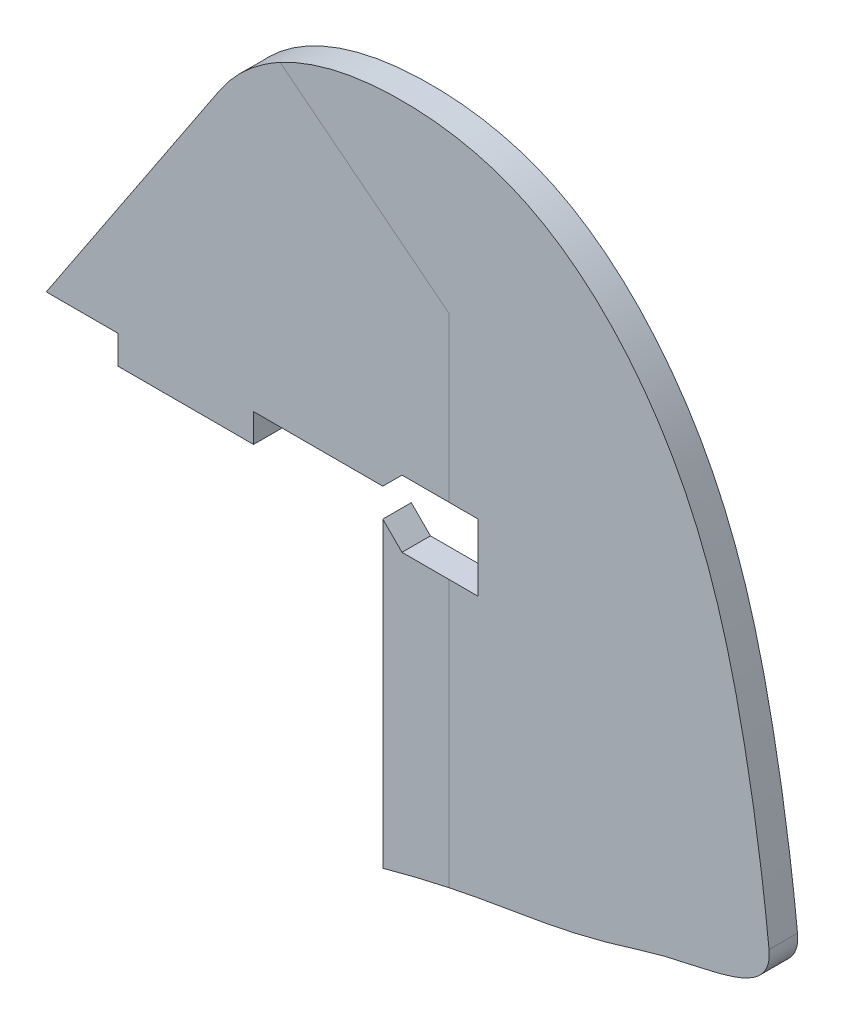
ISO-10303-21;
HEADER;
FILE_DESCRIPTION(('STEP AP214'),'2;1');
FILE_NAME('part.step','',(''),(''),'','','');
FILE_SCHEMA(('AUTOMOTIVE_DESIGN { 1 0 10303 214 1 1 1 1 }'));
ENDSEC;
DATA;
#1=APPLICATION_CONTEXT('core data for automotive mechanical design processes');
#2=APPLICATION_PROTOCOL_DEFINITION('international standard','automotive_design',2000,#1);
#3=PRODUCT_CONTEXT('',#1,'mechanical');
#4=PRODUCT('Part','Part','',(#3));
#5=PRODUCT_RELATED_PRODUCT_CATEGORY('part','',(#4));
#6=PRODUCT_DEFINITION_FORMATION('','',#4);
#7=PRODUCT_DEFINITION_CONTEXT('part definition',#1,'design');
#8=PRODUCT_DEFINITION('design','',#6,#7);
#9=PRODUCT_DEFINITION_SHAPE('','',#8);
#10=(LENGTH_UNIT() NAMED_UNIT(*) SI_UNIT(.MILLI.,.METRE.));
#11=(NAMED_UNIT(*) PLANE_ANGLE_UNIT() SI_UNIT($,.RADIAN.));
#12=(NAMED_UNIT(*) SI_UNIT($,.STERADIAN.) SOLID_ANGLE_UNIT());
#13=UNCERTAINTY_MEASURE_WITH_UNIT(LENGTH_MEASURE(1.E-05),#10,'distance_accuracy_value','');
#14=(GEOMETRIC_REPRESENTATION_CONTEXT(3) GLOBAL_UNCERTAINTY_ASSIGNED_CONTEXT((#13)) GLOBAL_UNIT_ASSIGNED_CONTEXT((#10,
#11,#12)) REPRESENTATION_CONTEXT('',''));
#15=CARTESIAN_POINT('',(0.,0.,0.));
#16=DIRECTION('',(0.,0.,1.));
#17=DIRECTION('',(1.,0.,0.));
#18=AXIS2_PLACEMENT_3D('',#15,#16,#17);
#19=CARTESIAN_POINT('',(0.,0.,2.667));
#20=DIRECTION('',(0.,0.,1.));
#21=DIRECTION('',(1.,0.,0.));
#22=AXIS2_PLACEMENT_3D('',#19,#20,#21);
#23=PLANE('',#22);
#24=DIRECTION('',(-0.707106781186552,-0.707106781186543,0.));
#25=VECTOR('',#24,1.);
#26=CARTESIAN_POINT('',(65.666068366198,4.00697940226357,2.667));
#27=LINE('',#26,#25);
#28=CARTESIAN_POINT('',(69.2581708146257,7.59908185069121,2.667));
#29=VERTEX_POINT('',#28);
#30=CARTESIAN_POINT('',(65.666068366198,4.00697940226357,2.667));
#31=VERTEX_POINT('',#30);
#32=EDGE_CURVE('E176',#29,#31,#27,.T.);
#33=ORIENTED_EDGE('',*,*,#32,.F.);
#34=DIRECTION('',(-1.,0.,0.));
#35=VECTOR('',#34,1.);
#36=CARTESIAN_POINT('',(83.446068366198,7.59908185069121,2.667));
#37=LINE('',#36,#35);
#38=CARTESIAN_POINT('',(78.0167474840947,7.59908185069121,2.667));
#39=VERTEX_POINT('',#38);
#40=EDGE_CURVE('E221',#39,#29,#37,.T.);
#41=ORIENTED_EDGE('',*,*,#40,.F.);
#42=DIRECTION('',(0.,1.,0.));
#43=VECTOR('',#42,1.);
#44=CARTESIAN_POINT('',(78.0167474840942,0.,2.667));
#45=LINE('',#44,#43);
#46=CARTESIAN_POINT('',(78.0167474840942,38.2575824735706,2.667));
#47=VERTEX_POINT('',#46);
#48=EDGE_CURVE('E203',#39,#47,#45,.T.);
#49=ORIENTED_EDGE('',*,*,#48,.T.);
#50=DIRECTION('',(-0.785764351366818,0.618525976916964,0.));
#51=VECTOR('',#50,1.);
#52=CARTESIAN_POINT('',(48.4409934326575,61.5385726787128,2.667));
#53=LINE('',#52,#51);
#54=CARTESIAN_POINT('',(46.4420874905384,63.1120409391049,2.667));
#55=VERTEX_POINT('',#54);
#56=EDGE_CURVE('E11',#47,#55,#53,.T.);
#57=ORIENTED_EDGE('',*,*,#56,.T.);
#58=CARTESIAN_POINT('',(35.1256612889572,52.9106732040363,2.667));
#59=CARTESIAN_POINT('',(37.9474296397344,57.1611743358798,2.667));
#60=CARTESIAN_POINT('',(47.971102481466,65.9423291174564,2.667));
#61=CARTESIAN_POINT('',(69.0084378411423,69.7517440980403,2.667));
#62=CARTESIAN_POINT('',(98.5076264172588,64.2411874513066,2.667));
#63=CARTESIAN_POINT('',(123.102162866821,36.6885902774405,2.667));
#64=CARTESIAN_POINT('',(133.317484482186,0.0651109229383884,2.667));
#65=CARTESIAN_POINT('',(136.807881475191,-23.8429808112873,2.667));
#66=CARTESIAN_POINT('',(137.976029916118,-34.9736234866786,2.667));
#67=B_SPLINE_CURVE_WITH_KNOTS('',3,(#58,#59,#60,#61,#62,#63,#64,#65,#66),.UNSPECIFIED.,.F.,.F.,
(4,1,1,1,1,1,4),(0.,0.0832450330887692,0.226858925181421,0.34728898037586,0.588091298684175,
0.805835077836797,1.),.UNSPECIFIED.);
#68=CARTESIAN_POINT('',(35.1256612889572,52.9106732040363,2.667));
#69=VERTEX_POINT('',#68);
#70=EDGE_CURVE('E231',#69,#55,#67,.T.);
#71=ORIENTED_EDGE('',*,*,#70,.F.);
#72=DIRECTION('',(0.553084487201441,0.833125170677924,0.));
#73=VECTOR('',#72,1.);
#74=CARTESIAN_POINT('',(0.,0.,2.667));
#75=LINE('',#74,#73);
#76=CARTESIAN_POINT('',(2.66010225825289,4.00697940226356,2.667));
#77=VERTEX_POINT('',#76);
#78=EDGE_CURVE('E237',#77,#69,#75,.T.);
#79=ORIENTED_EDGE('',*,*,#78,.F.);
#80=DIRECTION('',(-1.,0.,0.));
#81=VECTOR('',#80,1.);
#82=CARTESIAN_POINT('',(0.,4.00697940226356,2.667));
#83=LINE('',#82,#81);
#84=CARTESIAN_POINT('',(16.0757641262611,4.00697940226356,2.667));
#85=VERTEX_POINT('',#84);
#86=EDGE_CURVE('E238',#85,#77,#83,.T.);
#87=ORIENTED_EDGE('',*,*,#86,.F.);
#88=DIRECTION('',(0.,1.,0.));
#89=VECTOR('',#88,1.);
#90=CARTESIAN_POINT('',(16.0757641262611,-1.32702059773643,2.667));
#91=LINE('',#90,#89);
#92=CARTESIAN_POINT('',(16.0757641262611,-1.32702059773643,2.667));
#93=VERTEX_POINT('',#92);
#94=EDGE_CURVE('E345',#93,#85,#91,.T.);
#95=ORIENTED_EDGE('',*,*,#94,.F.);
#96=DIRECTION('',(-1.,0.,0.));
#97=VECTOR('',#96,1.);
#98=CARTESIAN_POINT('',(41.4757641262611,-1.32702059773643,2.667));
#99=LINE('',#98,#97);
#100=CARTESIAN_POINT('',(41.4757641262611,-1.32702059773643,2.667));
#101=VERTEX_POINT('',#100);
#102=EDGE_CURVE('E338',#101,#93,#99,.T.);
#103=ORIENTED_EDGE('',*,*,#102,.F.);
#104=DIRECTION('',(0.,1.,0.));
#105=VECTOR('',#104,1.);
#106=CARTESIAN_POINT('',(41.4757641262611,-1.32702059773643,2.667));
#107=LINE('',#106,#105);
#108=CARTESIAN_POINT('',(41.4757641262611,4.00697940226357,2.667));
#109=VERTEX_POINT('',#108);
#110=EDGE_CURVE('E347',#101,#109,#107,.T.);
#111=ORIENTED_EDGE('',*,*,#110,.T.);
#112=EDGE_CURVE('E373',#31,#109,#83,.T.);
#113=ORIENTED_EDGE('',*,*,#112,.F.);
#114=EDGE_LOOP('',(#33,#41,#49,#57,#71,#79,#87,#95,#103,#111,#113));
#115=FACE_BOUND('',#114,.T.);
#116=ADVANCED_FACE('F40',(#115),#23,.T.);
#117=CARTESIAN_POINT('',(0.,4.00697940226356,2.667));
#118=DIRECTION('',(0.,-1.,0.));
#119=DIRECTION('',(1.,0.,0.));
#120=AXIS2_PLACEMENT_3D('',#117,#118,#119);
#121=PLANE('',#120);
#122=ORIENTED_EDGE('',*,*,#112,.T.);
#123=DIRECTION('',(0.,0.,1.));
#124=VECTOR('',#123,1.);
#125=CARTESIAN_POINT('',(41.4757641262611,4.00697940226357,-2.667));
#126=LINE('',#125,#124);
#127=CARTESIAN_POINT('',(41.4757641262611,4.00697940226357,-2.667));
#128=VERTEX_POINT('',#127);
#129=EDGE_CURVE('E165',#128,#109,#126,.T.);
#130=ORIENTED_EDGE('',*,*,#129,.F.);
#131=DIRECTION('',(-1.,0.,0.));
#132=VECTOR('',#131,1.);
#133=CARTESIAN_POINT('',(0.,4.00697940226356,-2.667));
#134=LINE('',#133,#132);
#135=CARTESIAN_POINT('',(65.666068366198,4.00697940226357,-2.667));
#136=VERTEX_POINT('',#135);
#137=EDGE_CURVE('E185',#136,#128,#134,.T.);
#138=ORIENTED_EDGE('',*,*,#137,.F.);
#139=DIRECTION('',(0.,0.,-1.));
#140=VECTOR('',#139,1.);
#141=CARTESIAN_POINT('',(65.666068366198,4.00697940226357,2.667));
#142=LINE('',#141,#140);
#143=EDGE_CURVE('E195',#31,#136,#142,.T.);
#144=ORIENTED_EDGE('',*,*,#143,.F.);
#145=EDGE_LOOP('',(#122,#130,#138,#144));
#146=FACE_BOUND('',#145,.T.);
#147=ADVANCED_FACE('F257',(#146),#121,.T.);
#148=CARTESIAN_POINT('',(16.0757641262611,4.00697940226356,-2.667));
#149=VERTEX_POINT('',#148);
#150=CARTESIAN_POINT('',(2.66010225825289,4.00697940226356,-2.667));
#151=VERTEX_POINT('',#150);
#152=EDGE_CURVE('E189',#149,#151,#134,.T.);
#153=ORIENTED_EDGE('',*,*,#152,.F.);
#154=DIRECTION('',(0.,0.,-1.));
#155=VECTOR('',#154,1.);
#156=CARTESIAN_POINT('',(16.0757641262611,4.00697940226356,2.667));
#157=LINE('',#156,#155);
#158=EDGE_CURVE('E336',#85,#149,#157,.T.);
#159=ORIENTED_EDGE('',*,*,#158,.F.);
#160=ORIENTED_EDGE('',*,*,#86,.T.);
#161=DIRECTION('',(0.,0.,-1.));
#162=VECTOR('',#161,1.);
#163=CARTESIAN_POINT('',(2.66010225825289,4.00697940226356,2.667));
#164=LINE('',#163,#162);
#165=EDGE_CURVE('E197',#77,#151,#164,.T.);
#166=ORIENTED_EDGE('',*,*,#165,.T.);
#167=EDGE_LOOP('',(#153,#159,#160,#166));
#168=FACE_BOUND('',#167,.T.);
#169=ADVANCED_FACE('F260',(#168),#121,.T.);
#170=DIRECTION('',(1.,0.,0.));
#171=VECTOR('',#170,1.);
#172=CARTESIAN_POINT('',(83.446068366198,-4.91912304616406,2.667));
#173=LINE('',#172,#171);
#174=CARTESIAN_POINT('',(69.2581708146257,-4.91912304616406,2.667));
#175=VERTEX_POINT('',#174);
#176=CARTESIAN_POINT('',(78.0167474840947,-4.91912304616406,2.667));
#177=VERTEX_POINT('',#176);
#178=EDGE_CURVE('E310',#175,#177,#173,.T.);
#179=ORIENTED_EDGE('',*,*,#178,.F.);
#180=DIRECTION('',(0.707106781186554,-0.707106781186541,0.));
#181=VECTOR('',#180,1.);
#182=CARTESIAN_POINT('',(65.666068366198,-1.32702059773643,2.667));
#183=LINE('',#182,#181);
#184=CARTESIAN_POINT('',(65.666068366198,-1.32702059773643,2.667));
#185=VERTEX_POINT('',#184);
#186=EDGE_CURVE('E311',#185,#175,#183,.T.);
#187=ORIENTED_EDGE('',*,*,#186,.F.);
#188=DIRECTION('',(0.,1.,0.));
#189=VECTOR('',#188,1.);
#190=CARTESIAN_POINT('',(65.666068366198,0.,2.667));
#191=LINE('',#190,#189);
#192=CARTESIAN_POINT('',(65.666068366198,-57.9377529334846,2.667));
#193=VERTEX_POINT('',#192);
#194=EDGE_CURVE('E175',#193,#185,#191,.T.);
#195=ORIENTED_EDGE('',*,*,#194,.F.);
#196=CARTESIAN_POINT('',(137.976029916118,-34.9736234866786,2.667));
#197=CARTESIAN_POINT('',(138.815150474857,-42.9691408144953,2.667));
#198=CARTESIAN_POINT('',(124.639937030782,-43.6094816377659,2.667));
#199=CARTESIAN_POINT('',(103.232724242995,-50.5799985559844,2.667));
#200=CARTESIAN_POINT('',(88.6279712284508,-52.8063297096414,2.667));
#201=CARTESIAN_POINT('',(74.9940482948041,-55.3616650293275,2.667));
#202=CARTESIAN_POINT('',(65.666068366198,-57.9377529334846,2.667));
#203=B_SPLINE_CURVE_WITH_KNOTS('',3,(#196,#197,#198,#199,#200,#201,#202),.UNSPECIFIED.,.F.,.F.,
(4,1,1,1,4),(0.,0.302584462495957,0.371889791965306,0.693053294693484,1.),.UNSPECIFIED.);
#204=CARTESIAN_POINT('',(78.0167474840951,-54.9113959111609,2.667));
#205=VERTEX_POINT('',#204);
#206=EDGE_CURVE('E184',#205,#193,#203,.T.);
#207=ORIENTED_EDGE('',*,*,#206,.F.);
#208=EDGE_CURVE('E50',#205,#177,#45,.T.);
#209=ORIENTED_EDGE('',*,*,#208,.T.);
#210=EDGE_LOOP('',(#179,#187,#195,#207,#209));
#211=FACE_BOUND('',#210,.T.);
#212=ADVANCED_FACE('F269',(#211),#23,.T.);
#213=DIRECTION('',(0.,0.,-1.));
#214=VECTOR('',#213,1.);
#215=SURFACE_OF_LINEAR_EXTRUSION('',#203,#214);
#216=CARTESIAN_POINT('',(137.976029916118,-34.9736234866786,-2.667));
#217=CARTESIAN_POINT('',(138.815150474857,-42.9691408144953,-2.667));
#218=CARTESIAN_POINT('',(124.639937030782,-43.6094816377659,-2.667));
#219=CARTESIAN_POINT('',(103.232724242995,-50.5799985559844,-2.667));
#220=CARTESIAN_POINT('',(88.6279712284508,-52.8063297096414,-2.667));
#221=CARTESIAN_POINT('',(74.9940482948041,-55.3616650293275,-2.667));
#222=CARTESIAN_POINT('',(65.666068366198,-57.9377529334846,-2.667));
#223=B_SPLINE_CURVE_WITH_KNOTS('',3,(#216,#217,#218,#219,#220,#221,#222),.UNSPECIFIED.,.F.,.F.,
(4,1,1,1,4),(0.,0.302584462495957,0.371889791965306,0.693053294693484,1.),.UNSPECIFIED.);
#224=CARTESIAN_POINT('',(137.976029916118,-34.9736234866786,-2.667));
#225=VERTEX_POINT('',#224);
#226=CARTESIAN_POINT('',(65.666068366198,-57.9377529334846,-2.667));
#227=VERTEX_POINT('',#226);
#228=EDGE_CURVE('E183',#225,#227,#223,.T.);
#229=ORIENTED_EDGE('',*,*,#228,.F.);
#230=DIRECTION('',(0.,0.,-1.));
#231=VECTOR('',#230,1.);
#232=CARTESIAN_POINT('',(137.976029916118,-34.9736234866786,2.667));
#233=LINE('',#232,#231);
#234=CARTESIAN_POINT('',(137.976029916118,-34.9736234866786,2.667));
#235=VERTEX_POINT('',#234);
#236=EDGE_CURVE('E202',#235,#225,#233,.T.);
#237=ORIENTED_EDGE('',*,*,#236,.F.);
#238=EDGE_CURVE('E187',#235,#205,#203,.T.);
#239=ORIENTED_EDGE('',*,*,#238,.T.);
#240=ORIENTED_EDGE('',*,*,#206,.T.);
#241=DIRECTION('',(0.,0.,-1.));
#242=VECTOR('',#241,1.);
#243=CARTESIAN_POINT('',(65.666068366198,-57.9377529334846,2.667));
#244=LINE('',#243,#242);
#245=EDGE_CURVE('E193',#193,#227,#244,.T.);
#246=ORIENTED_EDGE('',*,*,#245,.T.);
#247=EDGE_LOOP('',(#229,#237,#239,#240,#246));
#248=FACE_BOUND('',#247,.T.);
#249=ADVANCED_FACE('F42',(#248),#215,.T.);
#250=DIRECTION('',(0.,0.,-1.));
#251=VECTOR('',#250,1.);
#252=SURFACE_OF_LINEAR_EXTRUSION('',#67,#251);
#253=CARTESIAN_POINT('',(35.1256612889572,52.9106732040363,-2.667));
#254=CARTESIAN_POINT('',(37.9474296397344,57.1611743358798,-2.667));
#255=CARTESIAN_POINT('',(47.971102481466,65.9423291174564,-2.667));
#256=CARTESIAN_POINT('',(69.0084378411423,69.7517440980403,-2.667));
#257=CARTESIAN_POINT('',(98.5076264172588,64.2411874513066,-2.667));
#258=CARTESIAN_POINT('',(123.102162866821,36.6885902774405,-2.667));
#259=CARTESIAN_POINT('',(133.317484482186,0.0651109229383884,-2.667));
#260=CARTESIAN_POINT('',(136.807881475191,-23.8429808112873,-2.667));
#261=CARTESIAN_POINT('',(137.976029916118,-34.9736234866786,-2.667));
#262=B_SPLINE_CURVE_WITH_KNOTS('',3,(#253,#254,#255,#256,#257,#258,#259,#260,#261),
.UNSPECIFIED.,.F.,.F.,(4,1,1,1,1,1,4),(0.,0.0832450330887692,0.226858925181421,0.34728898037586,
0.588091298684175,0.805835077836797,1.),.UNSPECIFIED.);
#263=CARTESIAN_POINT('',(35.1256612889572,52.9106732040363,-2.667));
#264=VERTEX_POINT('',#263);
#265=EDGE_CURVE('E352',#264,#225,#262,.T.);
#266=ORIENTED_EDGE('',*,*,#265,.F.);
#267=DIRECTION('',(0.,0.,-1.));
#268=VECTOR('',#267,1.);
#269=CARTESIAN_POINT('',(35.1256612889572,52.9106732040363,2.667));
#270=LINE('',#269,#268);
#271=EDGE_CURVE('E200',#69,#264,#270,.T.);
#272=ORIENTED_EDGE('',*,*,#271,.F.);
#273=ORIENTED_EDGE('',*,*,#70,.T.);
#274=EDGE_CURVE('E226',#55,#235,#67,.T.);
#275=ORIENTED_EDGE('',*,*,#274,.T.);
#276=ORIENTED_EDGE('',*,*,#236,.T.);
#277=EDGE_LOOP('',(#266,#272,#273,#275,#276));
#278=FACE_BOUND('',#277,.T.);
#279=ADVANCED_FACE('F234',(#278),#252,.T.);
#280=CARTESIAN_POINT('',(0.,0.,2.667));
#281=DIRECTION('',(-0.833125170677923,0.553084487201441,0.));
#282=DIRECTION('',(-0.553084487201441,-0.833125170677923,0.));
#283=AXIS2_PLACEMENT_3D('',#280,#281,#282);
#284=PLANE('',#283);
#285=DIRECTION('',(0.553084487201441,0.833125170677924,0.));
#286=VECTOR('',#285,1.);
#287=CARTESIAN_POINT('',(0.,0.,-2.667));
#288=LINE('',#287,#286);
#289=EDGE_CURVE('E354',#151,#264,#288,.T.);
#290=ORIENTED_EDGE('',*,*,#289,.F.);
#291=ORIENTED_EDGE('',*,*,#165,.F.);
#292=ORIENTED_EDGE('',*,*,#78,.T.);
#293=ORIENTED_EDGE('',*,*,#271,.T.);
#294=EDGE_LOOP('',(#290,#291,#292,#293));
#295=FACE_BOUND('',#294,.T.);
#296=ADVANCED_FACE('F253',(#295),#284,.T.);
#297=CARTESIAN_POINT('',(65.666068366198,0.,2.667));
#298=DIRECTION('',(-1.,0.,0.));
#299=DIRECTION('',(0.,0.,1.));
#300=AXIS2_PLACEMENT_3D('',#297,#298,#299);
#301=PLANE('',#300);
#302=DIRECTION('',(0.,0.,1.));
#303=VECTOR('',#302,1.);
#304=CARTESIAN_POINT('',(65.666068366198,-1.32702059773643,-2.668));
#305=LINE('',#304,#303);
#306=CARTESIAN_POINT('',(65.666068366198,-1.32702059773643,-2.667));
#307=VERTEX_POINT('',#306);
#308=EDGE_CURVE('E161',#307,#185,#305,.T.);
#309=ORIENTED_EDGE('',*,*,#308,.F.);
#310=DIRECTION('',(0.,1.,0.));
#311=VECTOR('',#310,1.);
#312=CARTESIAN_POINT('',(65.666068366198,0.,-2.667));
#313=LINE('',#312,#311);
#314=EDGE_CURVE('E173',#227,#307,#313,.T.);
#315=ORIENTED_EDGE('',*,*,#314,.F.);
#316=ORIENTED_EDGE('',*,*,#245,.F.);
#317=ORIENTED_EDGE('',*,*,#194,.T.);
#318=EDGE_LOOP('',(#309,#315,#316,#317));
#319=FACE_BOUND('',#318,.T.);
#320=ADVANCED_FACE('F171',(#319),#301,.T.);
#321=CARTESIAN_POINT('',(83.446068366198,7.59908185069121,2.667));
#322=VERTEX_POINT('',#321);
#323=EDGE_CURVE('E321',#322,#39,#37,.T.);
#324=ORIENTED_EDGE('',*,*,#323,.F.);
#325=DIRECTION('',(0.,1.,0.));
#326=VECTOR('',#325,1.);
#327=CARTESIAN_POINT('',(83.446068366198,-4.91912304616406,2.667));
#328=LINE('',#327,#326);
#329=CARTESIAN_POINT('',(83.446068366198,-4.91912304616406,2.667));
#330=VERTEX_POINT('',#329);
#331=EDGE_CURVE('E313',#330,#322,#328,.T.);
#332=ORIENTED_EDGE('',*,*,#331,.F.);
#333=EDGE_CURVE('E314',#177,#330,#173,.T.);
#334=ORIENTED_EDGE('',*,*,#333,.F.);
#335=ORIENTED_EDGE('',*,*,#208,.F.);
#336=ORIENTED_EDGE('',*,*,#238,.F.);
#337=ORIENTED_EDGE('',*,*,#274,.F.);
#338=ORIENTED_EDGE('',*,*,#56,.F.);
#339=ORIENTED_EDGE('',*,*,#48,.F.);
#340=EDGE_LOOP('',(#324,#332,#334,#335,#336,#337,#338,#339));
#341=FACE_BOUND('',#340,.T.);
#342=ADVANCED_FACE('F224',(#341),#23,.T.);
#343=CARTESIAN_POINT('',(0.,0.,-2.667));
#344=DIRECTION('',(0.,0.,1.));
#345=DIRECTION('',(1.,0.,0.));
#346=AXIS2_PLACEMENT_3D('',#343,#344,#345);
#347=PLANE('',#346);
#348=DIRECTION('',(1.,0.,0.));
#349=VECTOR('',#348,1.);
#350=CARTESIAN_POINT('',(83.446068366198,7.59908185069121,-2.667));
#351=LINE('',#350,#349);
#352=CARTESIAN_POINT('',(69.2581708146257,7.59908185069121,-2.667));
#353=VERTEX_POINT('',#352);
#354=CARTESIAN_POINT('',(83.446068366198,7.59908185069121,-2.667));
#355=VERTEX_POINT('',#354);
#356=EDGE_CURVE('E386',#353,#355,#351,.T.);
#357=ORIENTED_EDGE('',*,*,#356,.F.);
#358=DIRECTION('',(0.707106781186552,0.707106781186543,0.));
#359=VECTOR('',#358,1.);
#360=CARTESIAN_POINT('',(65.666068366198,4.00697940226357,-2.667));
#361=LINE('',#360,#359);
#362=EDGE_CURVE('E383',#136,#353,#361,.T.);
#363=ORIENTED_EDGE('',*,*,#362,.F.);
#364=ORIENTED_EDGE('',*,*,#137,.T.);
#365=DIRECTION('',(0.,1.,0.));
#366=VECTOR('',#365,1.);
#367=CARTESIAN_POINT('',(41.4757641262611,-1.32702059773643,-2.667));
#368=LINE('',#367,#366);
#369=CARTESIAN_POINT('',(41.4757641262611,-1.32702059773643,-2.667));
#370=VERTEX_POINT('',#369);
#371=EDGE_CURVE('E349',#370,#128,#368,.T.);
#372=ORIENTED_EDGE('',*,*,#371,.F.);
#373=DIRECTION('',(1.,0.,0.));
#374=VECTOR('',#373,1.);
#375=CARTESIAN_POINT('',(16.0757641262611,-1.32702059773643,-2.667));
#376=LINE('',#375,#374);
#377=CARTESIAN_POINT('',(16.0757641262611,-1.32702059773643,-2.667));
#378=VERTEX_POINT('',#377);
#379=EDGE_CURVE('E332',#378,#370,#376,.T.);
#380=ORIENTED_EDGE('',*,*,#379,.F.);
#381=DIRECTION('',(0.,1.,0.));
#382=VECTOR('',#381,1.);
#383=CARTESIAN_POINT('',(16.0757641262611,-1.32702059773643,-2.667));
#384=LINE('',#383,#382);
#385=EDGE_CURVE('E65',#378,#149,#384,.T.);
#386=ORIENTED_EDGE('',*,*,#385,.T.);
#387=ORIENTED_EDGE('',*,*,#152,.T.);
#388=ORIENTED_EDGE('',*,*,#289,.T.);
#389=ORIENTED_EDGE('',*,*,#265,.T.);
#390=ORIENTED_EDGE('',*,*,#228,.T.);
#391=ORIENTED_EDGE('',*,*,#314,.T.);
#392=DIRECTION('',(-0.707106781186554,0.707106781186541,0.));
#393=VECTOR('',#392,1.);
#394=CARTESIAN_POINT('',(65.666068366198,-1.32702059773643,-2.667));
#395=LINE('',#394,#393);
#396=CARTESIAN_POINT('',(69.2581708146257,-4.91912304616406,-2.667));
#397=VERTEX_POINT('',#396);
#398=EDGE_CURVE('E157',#397,#307,#395,.T.);
#399=ORIENTED_EDGE('',*,*,#398,.F.);
#400=DIRECTION('',(-1.,0.,0.));
#401=VECTOR('',#400,1.);
#402=CARTESIAN_POINT('',(83.446068366198,-4.91912304616406,-2.667));
#403=LINE('',#402,#401);
#404=CARTESIAN_POINT('',(83.446068366198,-4.91912304616406,-2.667));
#405=VERTEX_POINT('',#404);
#406=EDGE_CURVE('E57',#405,#397,#403,.T.);
#407=ORIENTED_EDGE('',*,*,#406,.F.);
#408=DIRECTION('',(0.,-1.,0.));
#409=VECTOR('',#408,1.);
#410=CARTESIAN_POINT('',(83.446068366198,-4.91912304616406,-2.667));
#411=LINE('',#410,#409);
#412=EDGE_CURVE('E387',#355,#405,#411,.T.);
#413=ORIENTED_EDGE('',*,*,#412,.F.);
#414=EDGE_LOOP('',(#357,#363,#364,#372,#380,#386,#387,#388,#389,#390,#391,#399,#407,#413));
#415=FACE_BOUND('',#414,.T.);
#416=ADVANCED_FACE('F180',(#415),#347,.F.);
#417=CARTESIAN_POINT('',(41.4757641262611,-1.32702059773643,-2.667));
#418=DIRECTION('',(-1.,0.,0.));
#419=DIRECTION('',(0.,-1.,0.));
#420=AXIS2_PLACEMENT_3D('',#417,#418,#419);
#421=PLANE('',#420);
#422=ORIENTED_EDGE('',*,*,#129,.T.);
#423=ORIENTED_EDGE('',*,*,#110,.F.);
#424=DIRECTION('',(0.,0.,1.));
#425=VECTOR('',#424,1.);
#426=CARTESIAN_POINT('',(41.4757641262611,-1.32702059773643,-2.667));
#427=LINE('',#426,#425);
#428=EDGE_CURVE('E335',#370,#101,#427,.T.);
#429=ORIENTED_EDGE('',*,*,#428,.F.);
#430=ORIENTED_EDGE('',*,*,#371,.T.);
#431=EDGE_LOOP('',(#422,#423,#429,#430));
#432=FACE_BOUND('',#431,.T.);
#433=ADVANCED_FACE('F266',(#432),#421,.F.);
#434=CARTESIAN_POINT('',(16.0757641262611,-1.32702059773643,2.667));
#435=DIRECTION('',(1.,0.,0.));
#436=DIRECTION('',(0.,1.,0.));
#437=AXIS2_PLACEMENT_3D('',#434,#435,#436);
#438=PLANE('',#437);
#439=ORIENTED_EDGE('',*,*,#158,.T.);
#440=ORIENTED_EDGE('',*,*,#385,.F.);
#441=DIRECTION('',(0.,0.,-1.));
#442=VECTOR('',#441,1.);
#443=CARTESIAN_POINT('',(16.0757641262611,-1.32702059773643,2.667));
#444=LINE('',#443,#442);
#445=EDGE_CURVE('E340',#93,#378,#444,.T.);
#446=ORIENTED_EDGE('',*,*,#445,.F.);
#447=ORIENTED_EDGE('',*,*,#94,.T.);
#448=EDGE_LOOP('',(#439,#440,#446,#447));
#449=FACE_BOUND('',#448,.T.);
#450=ADVANCED_FACE('F272',(#449),#438,.F.);
#451=CARTESIAN_POINT('',(0.,-1.32702059773644,0.));
#452=DIRECTION('',(0.,-1.,0.));
#453=DIRECTION('',(1.,0.,0.));
#454=AXIS2_PLACEMENT_3D('',#451,#452,#453);
#455=PLANE('',#454);
#456=ORIENTED_EDGE('',*,*,#379,.T.);
#457=ORIENTED_EDGE('',*,*,#428,.T.);
#458=ORIENTED_EDGE('',*,*,#102,.T.);
#459=ORIENTED_EDGE('',*,*,#445,.T.);
#460=EDGE_LOOP('',(#456,#457,#458,#459));
#461=FACE_BOUND('',#460,.T.);
#462=ADVANCED_FACE('F276',(#461),#455,.T.);
#463=CARTESIAN_POINT('',(65.666068366198,4.00697940226357,-2.668));
#464=DIRECTION('',(-0.707106781186543,0.707106781186552,0.));
#465=DIRECTION('',(-0.707106781186552,-0.707106781186543,0.));
#466=AXIS2_PLACEMENT_3D('',#463,#464,#465);
#467=PLANE('',#466);
#468=ORIENTED_EDGE('',*,*,#362,.T.);
#469=DIRECTION('',(0.,0.,1.));
#470=VECTOR('',#469,1.);
#471=CARTESIAN_POINT('',(69.2581708146257,7.59908185069121,-2.668));
#472=LINE('',#471,#470);
#473=EDGE_CURVE('E166',#353,#29,#472,.T.);
#474=ORIENTED_EDGE('',*,*,#473,.T.);
#475=ORIENTED_EDGE('',*,*,#32,.T.);
#476=ORIENTED_EDGE('',*,*,#143,.T.);
#477=EDGE_LOOP('',(#468,#474,#475,#476));
#478=FACE_BOUND('',#477,.T.);
#479=ADVANCED_FACE('F280',(#478),#467,.F.);
#480=CARTESIAN_POINT('',(83.446068366198,7.59908185069121,-2.668));
#481=DIRECTION('',(0.,1.,0.));
#482=DIRECTION('',(-1.,0.,0.));
#483=AXIS2_PLACEMENT_3D('',#480,#481,#482);
#484=PLANE('',#483);
#485=ORIENTED_EDGE('',*,*,#356,.T.);
#486=DIRECTION('',(0.,0.,1.));
#487=VECTOR('',#486,1.);
#488=CARTESIAN_POINT('',(83.446068366198,7.59908185069121,-2.668));
#489=LINE('',#488,#487);
#490=EDGE_CURVE('E326',#355,#322,#489,.T.);
#491=ORIENTED_EDGE('',*,*,#490,.T.);
#492=ORIENTED_EDGE('',*,*,#323,.T.);
#493=ORIENTED_EDGE('',*,*,#40,.T.);
#494=ORIENTED_EDGE('',*,*,#473,.F.);
#495=EDGE_LOOP('',(#485,#491,#492,#493,#494));
#496=FACE_BOUND('',#495,.T.);
#497=ADVANCED_FACE('F290',(#496),#484,.F.);
#498=CARTESIAN_POINT('',(83.446068366198,-4.91912304616406,-2.668));
#499=DIRECTION('',(1.,0.,0.));
#500=DIRECTION('',(0.,0.,-1.));
#501=AXIS2_PLACEMENT_3D('',#498,#499,#500);
#502=PLANE('',#501);
#503=ORIENTED_EDGE('',*,*,#412,.T.);
#504=DIRECTION('',(0.,0.,1.));
#505=VECTOR('',#504,1.);
#506=CARTESIAN_POINT('',(83.446068366198,-4.91912304616406,-2.668));
#507=LINE('',#506,#505);
#508=EDGE_CURVE('E328',#405,#330,#507,.T.);
#509=ORIENTED_EDGE('',*,*,#508,.T.);
#510=ORIENTED_EDGE('',*,*,#331,.T.);
#511=ORIENTED_EDGE('',*,*,#490,.F.);
#512=EDGE_LOOP('',(#503,#509,#510,#511));
#513=FACE_BOUND('',#512,.T.);
#514=ADVANCED_FACE('F287',(#513),#502,.F.);
#515=CARTESIAN_POINT('',(83.446068366198,-4.91912304616406,-2.668));
#516=DIRECTION('',(0.,-1.,0.));
#517=DIRECTION('',(1.,0.,0.));
#518=AXIS2_PLACEMENT_3D('',#515,#516,#517);
#519=PLANE('',#518);
#520=ORIENTED_EDGE('',*,*,#406,.T.);
#521=DIRECTION('',(0.,0.,1.));
#522=VECTOR('',#521,1.);
#523=CARTESIAN_POINT('',(69.2581708146257,-4.91912304616406,-2.668));
#524=LINE('',#523,#522);
#525=EDGE_CURVE('E163',#397,#175,#524,.T.);
#526=ORIENTED_EDGE('',*,*,#525,.T.);
#527=ORIENTED_EDGE('',*,*,#178,.T.);
#528=ORIENTED_EDGE('',*,*,#333,.T.);
#529=ORIENTED_EDGE('',*,*,#508,.F.);
#530=EDGE_LOOP('',(#520,#526,#527,#528,#529));
#531=FACE_BOUND('',#530,.T.);
#532=ADVANCED_FACE('F284',(#531),#519,.F.);
#533=CARTESIAN_POINT('',(65.666068366198,-1.32702059773643,-2.668));
#534=DIRECTION('',(-0.707106781186541,-0.707106781186554,0.));
#535=DIRECTION('',(0.707106781186554,-0.707106781186541,0.));
#536=AXIS2_PLACEMENT_3D('',#533,#534,#535);
#537=PLANE('',#536);
#538=ORIENTED_EDGE('',*,*,#398,.T.);
#539=ORIENTED_EDGE('',*,*,#308,.T.);
#540=ORIENTED_EDGE('',*,*,#186,.T.);
#541=ORIENTED_EDGE('',*,*,#525,.F.);
#542=EDGE_LOOP('',(#538,#539,#540,#541));
#543=FACE_BOUND('',#542,.T.);
#544=ADVANCED_FACE('F159',(#543),#537,.F.);
#545=CLOSED_SHELL('',(#116,#147,#169,#212,#249,#279,#296,#320,#342,#416,#433,#450,#462,#479,
#497,#514,#532,#544));
#546=MANIFOLD_SOLID_BREP('B2',#545);
#547=ADVANCED_BREP_SHAPE_REPRESENTATION('',(#18,#546),#14);
#548=SHAPE_DEFINITION_REPRESENTATION(#9,#547);
ENDSEC;
END-ISO-10303-21;
